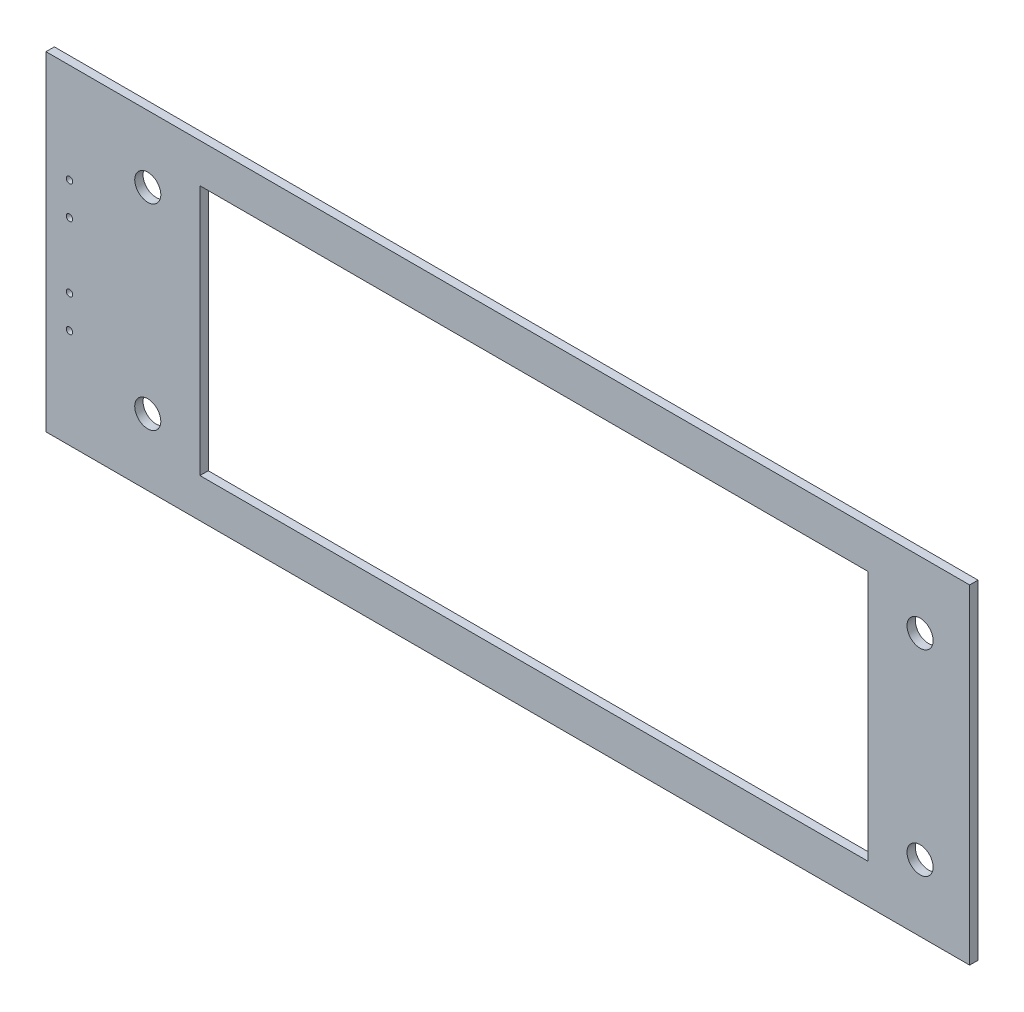
ISO-10303-21;
HEADER;
FILE_DESCRIPTION(('STEP AP214'),'2;1');
FILE_NAME('part.step','',(''),(''),'','','');
FILE_SCHEMA(('AUTOMOTIVE_DESIGN { 1 0 10303 214 1 1 1 1 }'));
ENDSEC;
DATA;
#1=APPLICATION_CONTEXT('core data for automotive mechanical design processes');
#2=APPLICATION_PROTOCOL_DEFINITION('international standard','automotive_design',2000,#1);
#3=PRODUCT_CONTEXT('',#1,'mechanical');
#4=PRODUCT('Part','Part','',(#3));
#5=PRODUCT_RELATED_PRODUCT_CATEGORY('part','',(#4));
#6=PRODUCT_DEFINITION_FORMATION('','',#4);
#7=PRODUCT_DEFINITION_CONTEXT('part definition',#1,'design');
#8=PRODUCT_DEFINITION('design','',#6,#7);
#9=PRODUCT_DEFINITION_SHAPE('','',#8);
#10=(LENGTH_UNIT() NAMED_UNIT(*) SI_UNIT(.MILLI.,.METRE.));
#11=(NAMED_UNIT(*) PLANE_ANGLE_UNIT() SI_UNIT($,.RADIAN.));
#12=(NAMED_UNIT(*) SI_UNIT($,.STERADIAN.) SOLID_ANGLE_UNIT());
#13=UNCERTAINTY_MEASURE_WITH_UNIT(LENGTH_MEASURE(1.E-05),#10,'distance_accuracy_value','');
#14=(GEOMETRIC_REPRESENTATION_CONTEXT(3) GLOBAL_UNCERTAINTY_ASSIGNED_CONTEXT((#13)) GLOBAL_UNIT_ASSIGNED_CONTEXT((#10,
#11,#12)) REPRESENTATION_CONTEXT('',''));
#15=CARTESIAN_POINT('',(0.,0.,0.));
#16=DIRECTION('',(0.,0.,1.));
#17=DIRECTION('',(1.,0.,0.));
#18=AXIS2_PLACEMENT_3D('',#15,#16,#17);
#19=CARTESIAN_POINT('',(0.,0.,0.));
#20=DIRECTION('',(0.,0.,1.));
#21=DIRECTION('',(1.,0.,0.));
#22=AXIS2_PLACEMENT_3D('',#19,#20,#21);
#23=PLANE('',#22);
#24=DIRECTION('',(1.,0.,0.));
#25=VECTOR('',#24,1.);
#26=CARTESIAN_POINT('',(-128.,48.1,0.));
#27=LINE('',#26,#25);
#28=CARTESIAN_POINT('',(-128.,48.1,0.));
#29=VERTEX_POINT('',#28);
#30=CARTESIAN_POINT('',(128.,48.1,0.));
#31=VERTEX_POINT('',#30);
#32=EDGE_CURVE('E200',#29,#31,#27,.T.);
#33=ORIENTED_EDGE('',*,*,#32,.F.);
#34=DIRECTION('',(0.,1.,0.));
#35=VECTOR('',#34,1.);
#36=CARTESIAN_POINT('',(-128.,-48.1,0.));
#37=LINE('',#36,#35);
#38=CARTESIAN_POINT('',(-128.,-48.1,0.));
#39=VERTEX_POINT('',#38);
#40=EDGE_CURVE('E279',#39,#29,#37,.T.);
#41=ORIENTED_EDGE('',*,*,#40,.F.);
#42=DIRECTION('',(-1.,0.,0.));
#43=VECTOR('',#42,1.);
#44=CARTESIAN_POINT('',(128.,-48.1,0.));
#45=LINE('',#44,#43);
#46=CARTESIAN_POINT('',(128.,-48.1,0.));
#47=VERTEX_POINT('',#46);
#48=EDGE_CURVE('E257',#47,#39,#45,.T.);
#49=ORIENTED_EDGE('',*,*,#48,.F.);
#50=DIRECTION('',(0.,-1.,0.));
#51=VECTOR('',#50,1.);
#52=CARTESIAN_POINT('',(128.,48.1,0.));
#53=LINE('',#52,#51);
#54=EDGE_CURVE('E215',#31,#47,#53,.T.);
#55=ORIENTED_EDGE('',*,*,#54,.F.);
#56=EDGE_LOOP('',(#33,#41,#49,#55));
#57=FACE_BOUND('',#56,.T.);
#58=CARTESIAN_POINT('',(-148.,37.6,0.));
#59=DIRECTION('',(0.,0.,1.));
#60=DIRECTION('',(1.,0.,0.));
#61=AXIS2_PLACEMENT_3D('',#58,#59,#60);
#62=CIRCLE('',#61,5.);
#63=CARTESIAN_POINT('',(-153.,37.6,0.));
#64=VERTEX_POINT('',#63);
#65=EDGE_CURVE('E229',#64,#64,#62,.T.);
#66=ORIENTED_EDGE('',*,*,#65,.T.);
#67=EDGE_LOOP('',(#66));
#68=FACE_BOUND('',#67,.T.);
#69=CARTESIAN_POINT('',(148.,-37.6,0.));
#70=DIRECTION('',(0.,0.,1.));
#71=DIRECTION('',(1.,0.,0.));
#72=AXIS2_PLACEMENT_3D('',#69,#70,#71);
#73=CIRCLE('',#72,5.);
#74=CARTESIAN_POINT('',(143.,-37.6,0.));
#75=VERTEX_POINT('',#74);
#76=EDGE_CURVE('E235',#75,#75,#73,.T.);
#77=ORIENTED_EDGE('',*,*,#76,.T.);
#78=EDGE_LOOP('',(#77));
#79=FACE_BOUND('',#78,.T.);
#80=CARTESIAN_POINT('',(-148.,-37.6,0.));
#81=DIRECTION('',(0.,0.,1.));
#82=DIRECTION('',(1.,0.,0.));
#83=AXIS2_PLACEMENT_3D('',#80,#81,#82);
#84=CIRCLE('',#83,5.);
#85=CARTESIAN_POINT('',(-153.,-37.6,0.));
#86=VERTEX_POINT('',#85);
#87=EDGE_CURVE('E263',#86,#86,#84,.T.);
#88=ORIENTED_EDGE('',*,*,#87,.T.);
#89=EDGE_LOOP('',(#88));
#90=FACE_BOUND('',#89,.T.);
#91=CARTESIAN_POINT('',(148.,37.6,0.));
#92=DIRECTION('',(0.,0.,1.));
#93=DIRECTION('',(1.,0.,0.));
#94=AXIS2_PLACEMENT_3D('',#91,#92,#93);
#95=CIRCLE('',#94,5.);
#96=CARTESIAN_POINT('',(143.,37.6,0.));
#97=VERTEX_POINT('',#96);
#98=EDGE_CURVE('E276',#97,#97,#95,.T.);
#99=ORIENTED_EDGE('',*,*,#98,.T.);
#100=EDGE_LOOP('',(#99));
#101=FACE_BOUND('',#100,.T.);
#102=CARTESIAN_POINT('',(-178.,-25.,0.));
#103=DIRECTION('',(0.,0.,1.));
#104=DIRECTION('',(1.,0.,0.));
#105=AXIS2_PLACEMENT_3D('',#102,#103,#104);
#106=CIRCLE('',#105,1.2295);
#107=CARTESIAN_POINT('',(-179.2295,-25.,0.));
#108=VERTEX_POINT('',#107);
#109=EDGE_CURVE('E325',#108,#108,#106,.T.);
#110=ORIENTED_EDGE('',*,*,#109,.T.);
#111=EDGE_LOOP('',(#110));
#112=FACE_BOUND('',#111,.T.);
#113=CARTESIAN_POINT('',(-178.,-12.5,0.));
#114=DIRECTION('',(0.,0.,1.));
#115=DIRECTION('',(1.,0.,0.));
#116=AXIS2_PLACEMENT_3D('',#113,#114,#115);
#117=CIRCLE('',#116,1.2295);
#118=CARTESIAN_POINT('',(-179.2295,-12.5,0.));
#119=VERTEX_POINT('',#118);
#120=EDGE_CURVE('E252',#119,#119,#117,.T.);
#121=ORIENTED_EDGE('',*,*,#120,.T.);
#122=EDGE_LOOP('',(#121));
#123=FACE_BOUND('',#122,.T.);
#124=CARTESIAN_POINT('',(-178.,12.5,0.));
#125=DIRECTION('',(0.,0.,1.));
#126=DIRECTION('',(1.,0.,0.));
#127=AXIS2_PLACEMENT_3D('',#124,#125,#126);
#128=CIRCLE('',#127,1.2295);
#129=CARTESIAN_POINT('',(-179.2295,12.5,0.));
#130=VERTEX_POINT('',#129);
#131=EDGE_CURVE('E304',#130,#130,#128,.T.);
#132=ORIENTED_EDGE('',*,*,#131,.T.);
#133=EDGE_LOOP('',(#132));
#134=FACE_BOUND('',#133,.T.);
#135=CARTESIAN_POINT('',(-178.,25.,0.));
#136=DIRECTION('',(0.,0.,1.));
#137=DIRECTION('',(1.,0.,0.));
#138=AXIS2_PLACEMENT_3D('',#135,#136,#137);
#139=CIRCLE('',#138,1.2295);
#140=CARTESIAN_POINT('',(-179.2295,25.,0.));
#141=VERTEX_POINT('',#140);
#142=EDGE_CURVE('E339',#141,#141,#139,.T.);
#143=ORIENTED_EDGE('',*,*,#142,.T.);
#144=EDGE_LOOP('',(#143));
#145=FACE_BOUND('',#144,.T.);
#146=DIRECTION('',(-1.,0.,0.));
#147=VECTOR('',#146,1.);
#148=CARTESIAN_POINT('',(167.,63.1,0.));
#149=LINE('',#148,#147);
#150=CARTESIAN_POINT('',(167.,63.1,0.));
#151=VERTEX_POINT('',#150);
#152=CARTESIAN_POINT('',(-187.,63.1,0.));
#153=VERTEX_POINT('',#152);
#154=EDGE_CURVE('E27',#151,#153,#149,.T.);
#155=ORIENTED_EDGE('',*,*,#154,.F.);
#156=DIRECTION('',(0.,1.,0.));
#157=VECTOR('',#156,1.);
#158=CARTESIAN_POINT('',(167.,-63.1,0.));
#159=LINE('',#158,#157);
#160=CARTESIAN_POINT('',(167.,-63.1,0.));
#161=VERTEX_POINT('',#160);
#162=EDGE_CURVE('E199',#161,#151,#159,.T.);
#163=ORIENTED_EDGE('',*,*,#162,.F.);
#164=DIRECTION('',(1.,0.,0.));
#165=VECTOR('',#164,1.);
#166=CARTESIAN_POINT('',(-167.,-63.1,0.));
#167=LINE('',#166,#165);
#168=CARTESIAN_POINT('',(-187.,-63.1,0.));
#169=VERTEX_POINT('',#168);
#170=EDGE_CURVE('E411',#169,#161,#167,.T.);
#171=ORIENTED_EDGE('',*,*,#170,.F.);
#172=DIRECTION('',(0.,-1.,0.));
#173=VECTOR('',#172,1.);
#174=CARTESIAN_POINT('',(-187.,63.1,0.));
#175=LINE('',#174,#173);
#176=EDGE_CURVE('E241',#153,#169,#175,.T.);
#177=ORIENTED_EDGE('',*,*,#176,.F.);
#178=EDGE_LOOP('',(#155,#163,#171,#177));
#179=FACE_BOUND('',#178,.T.);
#180=ADVANCED_FACE('F16',(#57,#68,#79,#90,#101,#112,#123,#134,#145,#179),#23,.F.);
#181=CARTESIAN_POINT('',(0.,0.,3.2));
#182=DIRECTION('',(0.,0.,1.));
#183=DIRECTION('',(1.,0.,0.));
#184=AXIS2_PLACEMENT_3D('',#181,#182,#183);
#185=PLANE('',#184);
#186=DIRECTION('',(1.,0.,0.));
#187=VECTOR('',#186,1.);
#188=CARTESIAN_POINT('',(-128.,48.1,3.2));
#189=LINE('',#188,#187);
#190=CARTESIAN_POINT('',(-128.,48.1,3.2));
#191=VERTEX_POINT('',#190);
#192=CARTESIAN_POINT('',(128.,48.1,3.2));
#193=VERTEX_POINT('',#192);
#194=EDGE_CURVE('E186',#191,#193,#189,.T.);
#195=ORIENTED_EDGE('',*,*,#194,.T.);
#196=DIRECTION('',(0.,-1.,0.));
#197=VECTOR('',#196,1.);
#198=CARTESIAN_POINT('',(128.,48.1,3.2));
#199=LINE('',#198,#197);
#200=CARTESIAN_POINT('',(128.,-48.1,3.2));
#201=VERTEX_POINT('',#200);
#202=EDGE_CURVE('E191',#193,#201,#199,.T.);
#203=ORIENTED_EDGE('',*,*,#202,.T.);
#204=DIRECTION('',(-1.,0.,0.));
#205=VECTOR('',#204,1.);
#206=CARTESIAN_POINT('',(128.,-48.1,3.2));
#207=LINE('',#206,#205);
#208=CARTESIAN_POINT('',(-128.,-48.1,3.2));
#209=VERTEX_POINT('',#208);
#210=EDGE_CURVE('E310',#201,#209,#207,.T.);
#211=ORIENTED_EDGE('',*,*,#210,.T.);
#212=DIRECTION('',(0.,1.,0.));
#213=VECTOR('',#212,1.);
#214=CARTESIAN_POINT('',(-128.,-48.1,3.2));
#215=LINE('',#214,#213);
#216=EDGE_CURVE('E194',#209,#191,#215,.T.);
#217=ORIENTED_EDGE('',*,*,#216,.T.);
#218=EDGE_LOOP('',(#195,#203,#211,#217));
#219=FACE_BOUND('',#218,.T.);
#220=CARTESIAN_POINT('',(-148.,37.6,3.2));
#221=DIRECTION('',(0.,0.,-1.));
#222=DIRECTION('',(1.,0.,0.));
#223=AXIS2_PLACEMENT_3D('',#220,#221,#222);
#224=CIRCLE('',#223,5.);
#225=CARTESIAN_POINT('',(-143.,37.6,3.2));
#226=VERTEX_POINT('',#225);
#227=CARTESIAN_POINT('',(-153.,37.6,3.2));
#228=VERTEX_POINT('',#227);
#229=EDGE_CURVE('E329',#226,#228,#224,.T.);
#230=ORIENTED_EDGE('',*,*,#229,.T.);
#231=CARTESIAN_POINT('',(-148.,37.6,3.2));
#232=DIRECTION('',(0.,0.,-1.));
#233=DIRECTION('',(1.,0.,0.));
#234=AXIS2_PLACEMENT_3D('',#231,#232,#233);
#235=CIRCLE('',#234,5.);
#236=EDGE_CURVE('E230',#228,#226,#235,.T.);
#237=ORIENTED_EDGE('',*,*,#236,.T.);
#238=EDGE_LOOP('',(#230,#237));
#239=FACE_BOUND('',#238,.T.);
#240=CARTESIAN_POINT('',(148.,-37.6,3.2));
#241=DIRECTION('',(0.,0.,-1.));
#242=DIRECTION('',(1.,0.,0.));
#243=AXIS2_PLACEMENT_3D('',#240,#241,#242);
#244=CIRCLE('',#243,5.);
#245=CARTESIAN_POINT('',(153.,-37.6,3.2));
#246=VERTEX_POINT('',#245);
#247=CARTESIAN_POINT('',(143.,-37.6,3.2));
#248=VERTEX_POINT('',#247);
#249=EDGE_CURVE('E266',#246,#248,#244,.T.);
#250=ORIENTED_EDGE('',*,*,#249,.T.);
#251=CARTESIAN_POINT('',(148.,-37.6,3.2));
#252=DIRECTION('',(0.,0.,-1.));
#253=DIRECTION('',(1.,0.,0.));
#254=AXIS2_PLACEMENT_3D('',#251,#252,#253);
#255=CIRCLE('',#254,5.);
#256=EDGE_CURVE('E236',#248,#246,#255,.T.);
#257=ORIENTED_EDGE('',*,*,#256,.T.);
#258=EDGE_LOOP('',(#250,#257));
#259=FACE_BOUND('',#258,.T.);
#260=CARTESIAN_POINT('',(-148.,-37.6,3.2));
#261=DIRECTION('',(0.,0.,-1.));
#262=DIRECTION('',(1.,0.,0.));
#263=AXIS2_PLACEMENT_3D('',#260,#261,#262);
#264=CIRCLE('',#263,5.);
#265=CARTESIAN_POINT('',(-143.,-37.6,3.2));
#266=VERTEX_POINT('',#265);
#267=CARTESIAN_POINT('',(-153.,-37.6,3.2));
#268=VERTEX_POINT('',#267);
#269=EDGE_CURVE('E272',#266,#268,#264,.T.);
#270=ORIENTED_EDGE('',*,*,#269,.T.);
#271=CARTESIAN_POINT('',(-148.,-37.6,3.2));
#272=DIRECTION('',(0.,0.,-1.));
#273=DIRECTION('',(1.,0.,0.));
#274=AXIS2_PLACEMENT_3D('',#271,#272,#273);
#275=CIRCLE('',#274,5.);
#276=EDGE_CURVE('E271',#268,#266,#275,.T.);
#277=ORIENTED_EDGE('',*,*,#276,.T.);
#278=EDGE_LOOP('',(#270,#277));
#279=FACE_BOUND('',#278,.T.);
#280=CARTESIAN_POINT('',(148.,37.6,3.2));
#281=DIRECTION('',(0.,0.,-1.));
#282=DIRECTION('',(1.,0.,0.));
#283=AXIS2_PLACEMENT_3D('',#280,#281,#282);
#284=CIRCLE('',#283,5.);
#285=CARTESIAN_POINT('',(153.,37.6,3.2));
#286=VERTEX_POINT('',#285);
#287=CARTESIAN_POINT('',(143.,37.6,3.2));
#288=VERTEX_POINT('',#287);
#289=EDGE_CURVE('E465',#286,#288,#284,.T.);
#290=ORIENTED_EDGE('',*,*,#289,.T.);
#291=CARTESIAN_POINT('',(148.,37.6,3.2));
#292=DIRECTION('',(0.,0.,-1.));
#293=DIRECTION('',(1.,0.,0.));
#294=AXIS2_PLACEMENT_3D('',#291,#292,#293);
#295=CIRCLE('',#294,5.);
#296=EDGE_CURVE('E354',#288,#286,#295,.T.);
#297=ORIENTED_EDGE('',*,*,#296,.T.);
#298=EDGE_LOOP('',(#290,#297));
#299=FACE_BOUND('',#298,.T.);
#300=CARTESIAN_POINT('',(-178.,-25.,3.2));
#301=DIRECTION('',(0.,0.,-1.));
#302=DIRECTION('',(1.,0.,0.));
#303=AXIS2_PLACEMENT_3D('',#300,#301,#302);
#304=CIRCLE('',#303,1.2295);
#305=CARTESIAN_POINT('',(-176.7705,-25.,3.2));
#306=VERTEX_POINT('',#305);
#307=CARTESIAN_POINT('',(-179.2295,-25.,3.2));
#308=VERTEX_POINT('',#307);
#309=EDGE_CURVE('E247',#306,#308,#304,.T.);
#310=ORIENTED_EDGE('',*,*,#309,.T.);
#311=CARTESIAN_POINT('',(-178.,-25.,3.2));
#312=DIRECTION('',(0.,0.,-1.));
#313=DIRECTION('',(1.,0.,0.));
#314=AXIS2_PLACEMENT_3D('',#311,#312,#313);
#315=CIRCLE('',#314,1.2295);
#316=EDGE_CURVE('E251',#308,#306,#315,.T.);
#317=ORIENTED_EDGE('',*,*,#316,.T.);
#318=EDGE_LOOP('',(#310,#317));
#319=FACE_BOUND('',#318,.T.);
#320=CARTESIAN_POINT('',(-178.,-12.5,3.2));
#321=DIRECTION('',(0.,0.,-1.));
#322=DIRECTION('',(1.,0.,0.));
#323=AXIS2_PLACEMENT_3D('',#320,#321,#322);
#324=CIRCLE('',#323,1.2295);
#325=CARTESIAN_POINT('',(-176.7705,-12.5,3.2));
#326=VERTEX_POINT('',#325);
#327=CARTESIAN_POINT('',(-179.2295,-12.5,3.2));
#328=VERTEX_POINT('',#327);
#329=EDGE_CURVE('E299',#326,#328,#324,.T.);
#330=ORIENTED_EDGE('',*,*,#329,.T.);
#331=CARTESIAN_POINT('',(-178.,-12.5,3.2));
#332=DIRECTION('',(0.,0.,-1.));
#333=DIRECTION('',(1.,0.,0.));
#334=AXIS2_PLACEMENT_3D('',#331,#332,#333);
#335=CIRCLE('',#334,1.2295);
#336=EDGE_CURVE('E303',#328,#326,#335,.T.);
#337=ORIENTED_EDGE('',*,*,#336,.T.);
#338=EDGE_LOOP('',(#330,#337));
#339=FACE_BOUND('',#338,.T.);
#340=CARTESIAN_POINT('',(-178.,12.5,3.2));
#341=DIRECTION('',(0.,0.,-1.));
#342=DIRECTION('',(1.,0.,0.));
#343=AXIS2_PLACEMENT_3D('',#340,#341,#342);
#344=CIRCLE('',#343,1.2295);
#345=CARTESIAN_POINT('',(-176.7705,12.5,3.2));
#346=VERTEX_POINT('',#345);
#347=CARTESIAN_POINT('',(-179.2295,12.5,3.2));
#348=VERTEX_POINT('',#347);
#349=EDGE_CURVE('E292',#346,#348,#344,.T.);
#350=ORIENTED_EDGE('',*,*,#349,.T.);
#351=CARTESIAN_POINT('',(-178.,12.5,3.2));
#352=DIRECTION('',(0.,0.,-1.));
#353=DIRECTION('',(1.,0.,0.));
#354=AXIS2_PLACEMENT_3D('',#351,#352,#353);
#355=CIRCLE('',#354,1.2295);
#356=EDGE_CURVE('E288',#348,#346,#355,.T.);
#357=ORIENTED_EDGE('',*,*,#356,.T.);
#358=EDGE_LOOP('',(#350,#357));
#359=FACE_BOUND('',#358,.T.);
#360=CARTESIAN_POINT('',(-178.,25.,3.2));
#361=DIRECTION('',(0.,0.,-1.));
#362=DIRECTION('',(1.,0.,0.));
#363=AXIS2_PLACEMENT_3D('',#360,#361,#362);
#364=CIRCLE('',#363,1.2295);
#365=CARTESIAN_POINT('',(-176.7705,25.,3.2));
#366=VERTEX_POINT('',#365);
#367=CARTESIAN_POINT('',(-179.2295,25.,3.2));
#368=VERTEX_POINT('',#367);
#369=EDGE_CURVE('E242',#366,#368,#364,.T.);
#370=ORIENTED_EDGE('',*,*,#369,.T.);
#371=CARTESIAN_POINT('',(-178.,25.,3.2));
#372=DIRECTION('',(0.,0.,-1.));
#373=DIRECTION('',(1.,0.,0.));
#374=AXIS2_PLACEMENT_3D('',#371,#372,#373);
#375=CIRCLE('',#374,1.2295);
#376=EDGE_CURVE('E246',#368,#366,#375,.T.);
#377=ORIENTED_EDGE('',*,*,#376,.T.);
#378=EDGE_LOOP('',(#370,#377));
#379=FACE_BOUND('',#378,.T.);
#380=DIRECTION('',(-1.,0.,0.));
#381=VECTOR('',#380,1.);
#382=CARTESIAN_POINT('',(167.,63.1,3.2));
#383=LINE('',#382,#381);
#384=CARTESIAN_POINT('',(167.,63.1,3.2));
#385=VERTEX_POINT('',#384);
#386=CARTESIAN_POINT('',(-187.,63.1,3.2));
#387=VERTEX_POINT('',#386);
#388=EDGE_CURVE('E11',#385,#387,#383,.T.);
#389=ORIENTED_EDGE('',*,*,#388,.T.);
#390=DIRECTION('',(0.,-1.,0.));
#391=VECTOR('',#390,1.);
#392=CARTESIAN_POINT('',(-187.,63.1,3.2));
#393=LINE('',#392,#391);
#394=CARTESIAN_POINT('',(-187.,-63.1,3.2));
#395=VERTEX_POINT('',#394);
#396=EDGE_CURVE('E237',#387,#395,#393,.T.);
#397=ORIENTED_EDGE('',*,*,#396,.T.);
#398=DIRECTION('',(1.,0.,0.));
#399=VECTOR('',#398,1.);
#400=CARTESIAN_POINT('',(-167.,-63.1,3.2));
#401=LINE('',#400,#399);
#402=CARTESIAN_POINT('',(167.,-63.1,3.2));
#403=VERTEX_POINT('',#402);
#404=EDGE_CURVE('E364',#395,#403,#401,.T.);
#405=ORIENTED_EDGE('',*,*,#404,.T.);
#406=DIRECTION('',(0.,1.,0.));
#407=VECTOR('',#406,1.);
#408=CARTESIAN_POINT('',(167.,-63.1,3.2));
#409=LINE('',#408,#407);
#410=EDGE_CURVE('E258',#403,#385,#409,.T.);
#411=ORIENTED_EDGE('',*,*,#410,.T.);
#412=EDGE_LOOP('',(#389,#397,#405,#411));
#413=FACE_BOUND('',#412,.T.);
#414=ADVANCED_FACE('F188',(#219,#239,#259,#279,#299,#319,#339,#359,#379,#413),#185,.T.);
#415=CARTESIAN_POINT('',(167.,63.1,0.));
#416=DIRECTION('',(0.,1.,0.));
#417=DIRECTION('',(1.,0.,0.));
#418=AXIS2_PLACEMENT_3D('',#415,#416,#417);
#419=PLANE('',#418);
#420=ORIENTED_EDGE('',*,*,#154,.T.);
#421=DIRECTION('',(0.,0.,1.));
#422=VECTOR('',#421,1.);
#423=CARTESIAN_POINT('',(-187.,63.1,0.));
#424=LINE('',#423,#422);
#425=EDGE_CURVE('E240',#153,#387,#424,.T.);
#426=ORIENTED_EDGE('',*,*,#425,.T.);
#427=ORIENTED_EDGE('',*,*,#388,.F.);
#428=DIRECTION('',(0.,0.,1.));
#429=VECTOR('',#428,1.);
#430=CARTESIAN_POINT('',(167.,63.1,0.));
#431=LINE('',#430,#429);
#432=EDGE_CURVE('E262',#151,#385,#431,.T.);
#433=ORIENTED_EDGE('',*,*,#432,.F.);
#434=EDGE_LOOP('',(#420,#426,#427,#433));
#435=FACE_BOUND('',#434,.T.);
#436=ADVANCED_FACE('F402',(#435),#419,.T.);
#437=CARTESIAN_POINT('',(-187.,63.1,0.));
#438=DIRECTION('',(-1.,0.,0.));
#439=DIRECTION('',(0.,0.,1.));
#440=AXIS2_PLACEMENT_3D('',#437,#438,#439);
#441=PLANE('',#440);
#442=ORIENTED_EDGE('',*,*,#176,.T.);
#443=DIRECTION('',(0.,0.,1.));
#444=VECTOR('',#443,1.);
#445=CARTESIAN_POINT('',(-187.,-63.1,0.));
#446=LINE('',#445,#444);
#447=EDGE_CURVE('E360',#169,#395,#446,.T.);
#448=ORIENTED_EDGE('',*,*,#447,.T.);
#449=ORIENTED_EDGE('',*,*,#396,.F.);
#450=ORIENTED_EDGE('',*,*,#425,.F.);
#451=EDGE_LOOP('',(#442,#448,#449,#450));
#452=FACE_BOUND('',#451,.T.);
#453=ADVANCED_FACE('F425',(#452),#441,.T.);
#454=CARTESIAN_POINT('',(-187.,-63.1,0.));
#455=DIRECTION('',(0.,-1.,0.));
#456=DIRECTION('',(0.,0.,-1.));
#457=AXIS2_PLACEMENT_3D('',#454,#455,#456);
#458=PLANE('',#457);
#459=ORIENTED_EDGE('',*,*,#170,.T.);
#460=DIRECTION('',(0.,0.,1.));
#461=VECTOR('',#460,1.);
#462=CARTESIAN_POINT('',(167.,-63.1,0.));
#463=LINE('',#462,#461);
#464=EDGE_CURVE('E261',#161,#403,#463,.T.);
#465=ORIENTED_EDGE('',*,*,#464,.T.);
#466=ORIENTED_EDGE('',*,*,#404,.F.);
#467=ORIENTED_EDGE('',*,*,#447,.F.);
#468=EDGE_LOOP('',(#459,#465,#466,#467));
#469=FACE_BOUND('',#468,.T.);
#470=ADVANCED_FACE('F427',(#469),#458,.T.);
#471=CARTESIAN_POINT('',(167.,-63.1,0.));
#472=DIRECTION('',(1.,0.,0.));
#473=DIRECTION('',(0.,1.,0.));
#474=AXIS2_PLACEMENT_3D('',#471,#472,#473);
#475=PLANE('',#474);
#476=ORIENTED_EDGE('',*,*,#162,.T.);
#477=ORIENTED_EDGE('',*,*,#432,.T.);
#478=ORIENTED_EDGE('',*,*,#410,.F.);
#479=ORIENTED_EDGE('',*,*,#464,.F.);
#480=EDGE_LOOP('',(#476,#477,#478,#479));
#481=FACE_BOUND('',#480,.T.);
#482=ADVANCED_FACE('F406',(#481),#475,.T.);
#483=CARTESIAN_POINT('',(-128.,48.1,0.));
#484=DIRECTION('',(0.,-1.,0.));
#485=DIRECTION('',(-1.,0.,0.));
#486=AXIS2_PLACEMENT_3D('',#483,#484,#485);
#487=PLANE('',#486);
#488=ORIENTED_EDGE('',*,*,#32,.T.);
#489=DIRECTION('',(0.,0.,1.));
#490=VECTOR('',#489,1.);
#491=CARTESIAN_POINT('',(128.,48.1,0.));
#492=LINE('',#491,#490);
#493=EDGE_CURVE('E203',#31,#193,#492,.T.);
#494=ORIENTED_EDGE('',*,*,#493,.T.);
#495=ORIENTED_EDGE('',*,*,#194,.F.);
#496=DIRECTION('',(0.,0.,1.));
#497=VECTOR('',#496,1.);
#498=CARTESIAN_POINT('',(-128.,48.1,0.));
#499=LINE('',#498,#497);
#500=EDGE_CURVE('E293',#29,#191,#499,.T.);
#501=ORIENTED_EDGE('',*,*,#500,.F.);
#502=EDGE_LOOP('',(#488,#494,#495,#501));
#503=FACE_BOUND('',#502,.T.);
#504=ADVANCED_FACE('F204',(#503),#487,.T.);
#505=CARTESIAN_POINT('',(128.,48.1,0.));
#506=DIRECTION('',(-1.,0.,0.));
#507=DIRECTION('',(0.,1.,0.));
#508=AXIS2_PLACEMENT_3D('',#505,#506,#507);
#509=PLANE('',#508);
#510=ORIENTED_EDGE('',*,*,#54,.T.);
#511=DIRECTION('',(0.,0.,1.));
#512=VECTOR('',#511,1.);
#513=CARTESIAN_POINT('',(128.,-48.1,0.));
#514=LINE('',#513,#512);
#515=EDGE_CURVE('E212',#47,#201,#514,.T.);
#516=ORIENTED_EDGE('',*,*,#515,.T.);
#517=ORIENTED_EDGE('',*,*,#202,.F.);
#518=ORIENTED_EDGE('',*,*,#493,.F.);
#519=EDGE_LOOP('',(#510,#516,#517,#518));
#520=FACE_BOUND('',#519,.T.);
#521=ADVANCED_FACE('F210',(#520),#509,.T.);
#522=CARTESIAN_POINT('',(128.,-48.1,0.));
#523=DIRECTION('',(0.,1.,0.));
#524=DIRECTION('',(1.,0.,0.));
#525=AXIS2_PLACEMENT_3D('',#522,#523,#524);
#526=PLANE('',#525);
#527=ORIENTED_EDGE('',*,*,#48,.T.);
#528=DIRECTION('',(0.,0.,1.));
#529=VECTOR('',#528,1.);
#530=CARTESIAN_POINT('',(-128.,-48.1,0.));
#531=LINE('',#530,#529);
#532=EDGE_CURVE('E253',#39,#209,#531,.T.);
#533=ORIENTED_EDGE('',*,*,#532,.T.);
#534=ORIENTED_EDGE('',*,*,#210,.F.);
#535=ORIENTED_EDGE('',*,*,#515,.F.);
#536=EDGE_LOOP('',(#527,#533,#534,#535));
#537=FACE_BOUND('',#536,.T.);
#538=ADVANCED_FACE('F18',(#537),#526,.T.);
#539=CARTESIAN_POINT('',(-128.,-48.1,0.));
#540=DIRECTION('',(1.,0.,0.));
#541=DIRECTION('',(0.,1.,0.));
#542=AXIS2_PLACEMENT_3D('',#539,#540,#541);
#543=PLANE('',#542);
#544=ORIENTED_EDGE('',*,*,#40,.T.);
#545=ORIENTED_EDGE('',*,*,#500,.T.);
#546=ORIENTED_EDGE('',*,*,#216,.F.);
#547=ORIENTED_EDGE('',*,*,#532,.F.);
#548=EDGE_LOOP('',(#544,#545,#546,#547));
#549=FACE_BOUND('',#548,.T.);
#550=ADVANCED_FACE('F445',(#549),#543,.T.);
#551=CARTESIAN_POINT('',(-148.,37.6,3.2));
#552=DIRECTION('',(0.,0.,-1.));
#553=DIRECTION('',(1.,0.,0.));
#554=AXIS2_PLACEMENT_3D('',#551,#552,#553);
#555=CYLINDRICAL_SURFACE('',#554,5.);
#556=ORIENTED_EDGE('',*,*,#229,.F.);
#557=ORIENTED_EDGE('',*,*,#236,.F.);
#558=DIRECTION('',(0.,0.,-1.));
#559=VECTOR('',#558,1.);
#560=CARTESIAN_POINT('',(-153.,37.6,3.2));
#561=LINE('',#560,#559);
#562=EDGE_CURVE('E226',#228,#64,#561,.T.);
#563=ORIENTED_EDGE('',*,*,#562,.T.);
#564=ORIENTED_EDGE('',*,*,#65,.F.);
#565=ORIENTED_EDGE('',*,*,#562,.F.);
#566=EDGE_LOOP('',(#556,#557,#563,#564,#565));
#567=FACE_BOUND('',#566,.T.);
#568=ADVANCED_FACE('F441',(#567),#555,.F.);
#569=CARTESIAN_POINT('',(148.,-37.6,3.2));
#570=DIRECTION('',(0.,0.,-1.));
#571=DIRECTION('',(1.,0.,0.));
#572=AXIS2_PLACEMENT_3D('',#569,#570,#571);
#573=CYLINDRICAL_SURFACE('',#572,5.);
#574=ORIENTED_EDGE('',*,*,#249,.F.);
#575=ORIENTED_EDGE('',*,*,#256,.F.);
#576=DIRECTION('',(0.,0.,-1.));
#577=VECTOR('',#576,1.);
#578=CARTESIAN_POINT('',(143.,-37.6,3.2));
#579=LINE('',#578,#577);
#580=EDGE_CURVE('E231',#248,#75,#579,.T.);
#581=ORIENTED_EDGE('',*,*,#580,.T.);
#582=ORIENTED_EDGE('',*,*,#76,.F.);
#583=ORIENTED_EDGE('',*,*,#580,.F.);
#584=EDGE_LOOP('',(#574,#575,#581,#582,#583));
#585=FACE_BOUND('',#584,.T.);
#586=ADVANCED_FACE('F444',(#585),#573,.F.);
#587=CARTESIAN_POINT('',(-148.,-37.6,3.2));
#588=DIRECTION('',(0.,0.,-1.));
#589=DIRECTION('',(1.,0.,0.));
#590=AXIS2_PLACEMENT_3D('',#587,#588,#589);
#591=CYLINDRICAL_SURFACE('',#590,5.);
#592=ORIENTED_EDGE('',*,*,#269,.F.);
#593=ORIENTED_EDGE('',*,*,#276,.F.);
#594=DIRECTION('',(0.,0.,-1.));
#595=VECTOR('',#594,1.);
#596=CARTESIAN_POINT('',(-153.,-37.6,3.2));
#597=LINE('',#596,#595);
#598=EDGE_CURVE('E267',#268,#86,#597,.T.);
#599=ORIENTED_EDGE('',*,*,#598,.T.);
#600=ORIENTED_EDGE('',*,*,#87,.F.);
#601=ORIENTED_EDGE('',*,*,#598,.F.);
#602=EDGE_LOOP('',(#592,#593,#599,#600,#601));
#603=FACE_BOUND('',#602,.T.);
#604=ADVANCED_FACE('F378',(#603),#591,.F.);
#605=CARTESIAN_POINT('',(148.,37.6,3.2));
#606=DIRECTION('',(0.,0.,-1.));
#607=DIRECTION('',(1.,0.,0.));
#608=AXIS2_PLACEMENT_3D('',#605,#606,#607);
#609=CYLINDRICAL_SURFACE('',#608,5.);
#610=ORIENTED_EDGE('',*,*,#289,.F.);
#611=ORIENTED_EDGE('',*,*,#296,.F.);
#612=DIRECTION('',(0.,0.,-1.));
#613=VECTOR('',#612,1.);
#614=CARTESIAN_POINT('',(143.,37.6,3.2));
#615=LINE('',#614,#613);
#616=EDGE_CURVE('E334',#288,#97,#615,.T.);
#617=ORIENTED_EDGE('',*,*,#616,.T.);
#618=ORIENTED_EDGE('',*,*,#98,.F.);
#619=ORIENTED_EDGE('',*,*,#616,.F.);
#620=EDGE_LOOP('',(#610,#611,#617,#618,#619));
#621=FACE_BOUND('',#620,.T.);
#622=ADVANCED_FACE('F451',(#621),#609,.F.);
#623=CARTESIAN_POINT('',(-178.,-25.,-1.8));
#624=DIRECTION('',(0.,0.,1.));
#625=DIRECTION('',(1.,0.,0.));
#626=AXIS2_PLACEMENT_3D('',#623,#624,#625);
#627=CYLINDRICAL_SURFACE('',#626,1.2295);
#628=ORIENTED_EDGE('',*,*,#309,.F.);
#629=ORIENTED_EDGE('',*,*,#316,.F.);
#630=DIRECTION('',(0.,0.,-1.));
#631=VECTOR('',#630,1.);
#632=CARTESIAN_POINT('',(-179.2295,-25.,-1.8));
#633=LINE('',#632,#631);
#634=EDGE_CURVE('E285',#308,#108,#633,.T.);
#635=ORIENTED_EDGE('',*,*,#634,.T.);
#636=ORIENTED_EDGE('',*,*,#109,.F.);
#637=ORIENTED_EDGE('',*,*,#634,.F.);
#638=EDGE_LOOP('',(#628,#629,#635,#636,#637));
#639=FACE_BOUND('',#638,.T.);
#640=ADVANCED_FACE('F453',(#639),#627,.F.);
#641=CARTESIAN_POINT('',(-178.,-12.5,-1.8));
#642=DIRECTION('',(0.,0.,1.));
#643=DIRECTION('',(1.,0.,0.));
#644=AXIS2_PLACEMENT_3D('',#641,#642,#643);
#645=CYLINDRICAL_SURFACE('',#644,1.2295);
#646=ORIENTED_EDGE('',*,*,#329,.F.);
#647=ORIENTED_EDGE('',*,*,#336,.F.);
#648=DIRECTION('',(0.,0.,-1.));
#649=VECTOR('',#648,1.);
#650=CARTESIAN_POINT('',(-179.2295,-12.5,-1.8));
#651=LINE('',#650,#649);
#652=EDGE_CURVE('E20',#328,#119,#651,.T.);
#653=ORIENTED_EDGE('',*,*,#652,.T.);
#654=ORIENTED_EDGE('',*,*,#120,.F.);
#655=ORIENTED_EDGE('',*,*,#652,.F.);
#656=EDGE_LOOP('',(#646,#647,#653,#654,#655));
#657=FACE_BOUND('',#656,.T.);
#658=ADVANCED_FACE('F459',(#657),#645,.F.);
#659=CARTESIAN_POINT('',(-178.,12.5,-1.8));
#660=DIRECTION('',(0.,0.,1.));
#661=DIRECTION('',(1.,0.,0.));
#662=AXIS2_PLACEMENT_3D('',#659,#660,#661);
#663=CYLINDRICAL_SURFACE('',#662,1.2295);
#664=ORIENTED_EDGE('',*,*,#349,.F.);
#665=ORIENTED_EDGE('',*,*,#356,.F.);
#666=DIRECTION('',(0.,0.,-1.));
#667=VECTOR('',#666,1.);
#668=CARTESIAN_POINT('',(-179.2295,12.5,-1.8));
#669=LINE('',#668,#667);
#670=EDGE_CURVE('E291',#348,#130,#669,.T.);
#671=ORIENTED_EDGE('',*,*,#670,.T.);
#672=ORIENTED_EDGE('',*,*,#131,.F.);
#673=ORIENTED_EDGE('',*,*,#670,.F.);
#674=EDGE_LOOP('',(#664,#665,#671,#672,#673));
#675=FACE_BOUND('',#674,.T.);
#676=ADVANCED_FACE('F542',(#675),#663,.F.);
#677=CARTESIAN_POINT('',(-178.,25.,-1.8));
#678=DIRECTION('',(0.,0.,1.));
#679=DIRECTION('',(1.,0.,0.));
#680=AXIS2_PLACEMENT_3D('',#677,#678,#679);
#681=CYLINDRICAL_SURFACE('',#680,1.2295);
#682=ORIENTED_EDGE('',*,*,#369,.F.);
#683=ORIENTED_EDGE('',*,*,#376,.F.);
#684=DIRECTION('',(0.,0.,-1.));
#685=VECTOR('',#684,1.);
#686=CARTESIAN_POINT('',(-179.2295,25.,-1.8));
#687=LINE('',#686,#685);
#688=EDGE_CURVE('E224',#368,#141,#687,.T.);
#689=ORIENTED_EDGE('',*,*,#688,.T.);
#690=ORIENTED_EDGE('',*,*,#142,.F.);
#691=ORIENTED_EDGE('',*,*,#688,.F.);
#692=EDGE_LOOP('',(#682,#683,#689,#690,#691));
#693=FACE_BOUND('',#692,.T.);
#694=ADVANCED_FACE('F478',(#693),#681,.F.);
#695=CLOSED_SHELL('',(#180,#414,#436,#453,#470,#482,#504,#521,#538,#550,#568,#586,#604,#622,
#640,#658,#676,#694));
#696=MANIFOLD_SOLID_BREP('B1',#695);
#697=ADVANCED_BREP_SHAPE_REPRESENTATION('',(#18,#696),#14);
#698=SHAPE_DEFINITION_REPRESENTATION(#9,#697);
ENDSEC;
END-ISO-10303-21;
